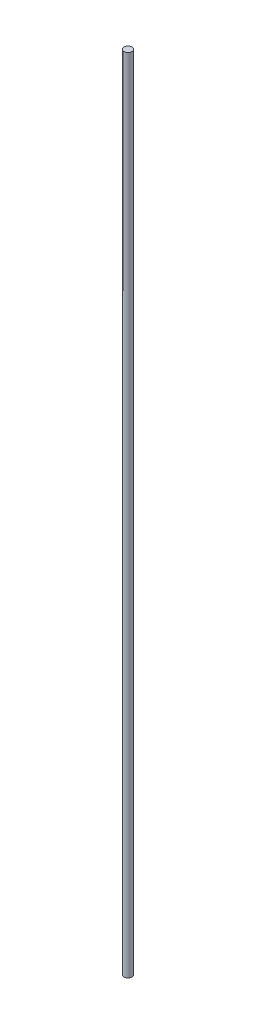
ISO-10303-21;
HEADER;
FILE_DESCRIPTION(('STEP AP214'),'2;1');
FILE_NAME('part.step','',(''),(''),'','','');
FILE_SCHEMA(('AUTOMOTIVE_DESIGN { 1 0 10303 214 1 1 1 1 }'));
ENDSEC;
DATA;
#1=APPLICATION_CONTEXT('core data for automotive mechanical design processes');
#2=APPLICATION_PROTOCOL_DEFINITION('international standard','automotive_design',2000,#1);
#3=PRODUCT_CONTEXT('',#1,'mechanical');
#4=PRODUCT('Part','Part','',(#3));
#5=PRODUCT_RELATED_PRODUCT_CATEGORY('part','',(#4));
#6=PRODUCT_DEFINITION_FORMATION('','',#4);
#7=PRODUCT_DEFINITION_CONTEXT('part definition',#1,'design');
#8=PRODUCT_DEFINITION('design','',#6,#7);
#9=PRODUCT_DEFINITION_SHAPE('','',#8);
#10=(LENGTH_UNIT() NAMED_UNIT(*) SI_UNIT(.MILLI.,.METRE.));
#11=(NAMED_UNIT(*) PLANE_ANGLE_UNIT() SI_UNIT($,.RADIAN.));
#12=(NAMED_UNIT(*) SI_UNIT($,.STERADIAN.) SOLID_ANGLE_UNIT());
#13=UNCERTAINTY_MEASURE_WITH_UNIT(LENGTH_MEASURE(1.E-05),#10,'distance_accuracy_value','');
#14=(GEOMETRIC_REPRESENTATION_CONTEXT(3) GLOBAL_UNCERTAINTY_ASSIGNED_CONTEXT((#13)) GLOBAL_UNIT_ASSIGNED_CONTEXT((#10,
#11,#12)) REPRESENTATION_CONTEXT('',''));
#15=CARTESIAN_POINT('',(0.,0.,0.));
#16=DIRECTION('',(0.,0.,1.));
#17=DIRECTION('',(1.,0.,0.));
#18=AXIS2_PLACEMENT_3D('',#15,#16,#17);
#19=CARTESIAN_POINT('',(0.,2400.,0.));
#20=DIRECTION('',(0.,-1.,0.));
#21=DIRECTION('',(0.,0.,-1.));
#22=AXIS2_PLACEMENT_3D('',#19,#20,#21);
#23=CYLINDRICAL_SURFACE('',#22,12.);
#24=CARTESIAN_POINT('',(0.,2400.,0.));
#25=DIRECTION('',(0.,1.,0.));
#26=DIRECTION('',(0.,0.,1.));
#27=AXIS2_PLACEMENT_3D('',#24,#25,#26);
#28=CIRCLE('',#27,12.);
#29=CARTESIAN_POINT('',(0.,2400.,12.));
#30=VERTEX_POINT('',#29);
#31=EDGE_CURVE('E10',#30,#30,#28,.T.);
#32=ORIENTED_EDGE('',*,*,#31,.F.);
#33=EDGE_LOOP('',(#32));
#34=FACE_BOUND('',#33,.T.);
#35=CARTESIAN_POINT('',(0.,0.,0.));
#36=DIRECTION('',(0.,1.,0.));
#37=DIRECTION('',(0.,0.,1.));
#38=AXIS2_PLACEMENT_3D('',#35,#36,#37);
#39=CIRCLE('',#38,12.);
#40=CARTESIAN_POINT('',(0.,0.,12.));
#41=VERTEX_POINT('',#40);
#42=EDGE_CURVE('E34',#41,#41,#39,.T.);
#43=ORIENTED_EDGE('',*,*,#42,.T.);
#44=EDGE_LOOP('',(#43));
#45=FACE_BOUND('',#44,.T.);
#46=ADVANCED_FACE('F31',(#34,#45),#23,.T.);
#47=CARTESIAN_POINT('',(0.,2400.,0.));
#48=DIRECTION('',(0.,1.,0.));
#49=DIRECTION('',(0.,0.,1.));
#50=AXIS2_PLACEMENT_3D('',#47,#48,#49);
#51=PLANE('',#50);
#52=ORIENTED_EDGE('',*,*,#31,.T.);
#53=EDGE_LOOP('',(#52));
#54=FACE_BOUND('',#53,.T.);
#55=ADVANCED_FACE('F46',(#54),#51,.T.);
#56=CARTESIAN_POINT('',(0.,0.,0.));
#57=DIRECTION('',(0.,1.,0.));
#58=DIRECTION('',(0.,0.,1.));
#59=AXIS2_PLACEMENT_3D('',#56,#57,#58);
#60=PLANE('',#59);
#61=ORIENTED_EDGE('',*,*,#42,.F.);
#62=EDGE_LOOP('',(#61));
#63=FACE_BOUND('',#62,.T.);
#64=ADVANCED_FACE('F44',(#63),#60,.F.);
#65=CLOSED_SHELL('',(#46,#55,#64));
#66=MANIFOLD_SOLID_BREP('B2',#65);
#67=ADVANCED_BREP_SHAPE_REPRESENTATION('',(#18,#66),#14);
#68=SHAPE_DEFINITION_REPRESENTATION(#9,#67);
ENDSEC;
END-ISO-10303-21;
